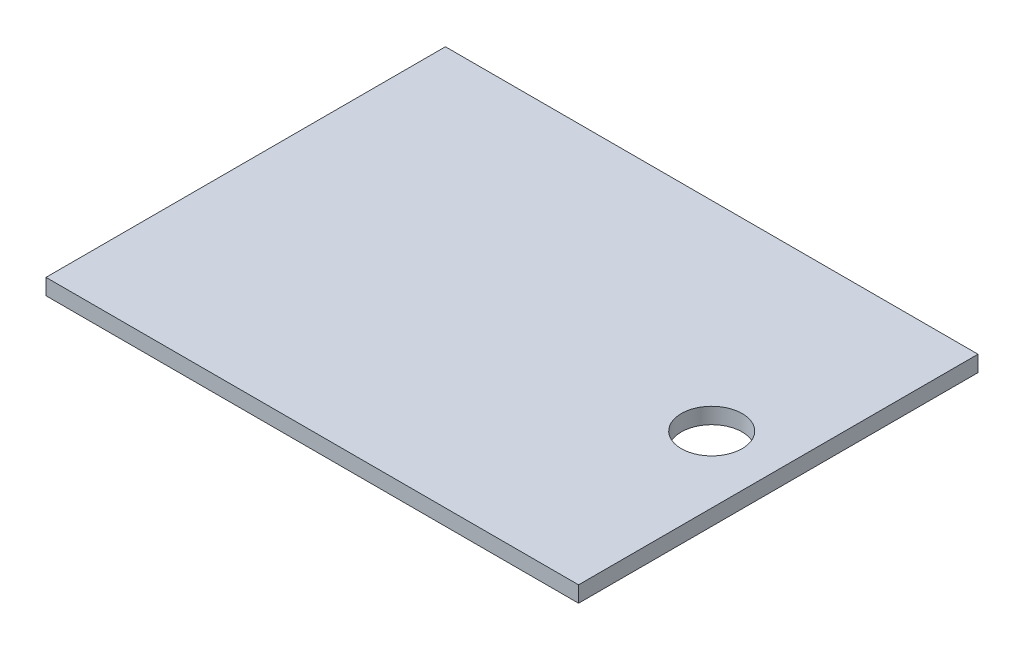
ISO-10303-21;
HEADER;
FILE_DESCRIPTION(('STEP AP214'),'2;1');
FILE_NAME('part.step','',(''),(''),'','','');
FILE_SCHEMA(('AUTOMOTIVE_DESIGN { 1 0 10303 214 1 1 1 1 }'));
ENDSEC;
DATA;
#1=APPLICATION_CONTEXT('core data for automotive mechanical design processes');
#2=APPLICATION_PROTOCOL_DEFINITION('international standard','automotive_design',2000,#1);
#3=PRODUCT_CONTEXT('',#1,'mechanical');
#4=PRODUCT('Part','Part','',(#3));
#5=PRODUCT_RELATED_PRODUCT_CATEGORY('part','',(#4));
#6=PRODUCT_DEFINITION_FORMATION('','',#4);
#7=PRODUCT_DEFINITION_CONTEXT('part definition',#1,'design');
#8=PRODUCT_DEFINITION('design','',#6,#7);
#9=PRODUCT_DEFINITION_SHAPE('','',#8);
#10=(LENGTH_UNIT() NAMED_UNIT(*) SI_UNIT(.MILLI.,.METRE.));
#11=(NAMED_UNIT(*) PLANE_ANGLE_UNIT() SI_UNIT($,.RADIAN.));
#12=(NAMED_UNIT(*) SI_UNIT($,.STERADIAN.) SOLID_ANGLE_UNIT());
#13=UNCERTAINTY_MEASURE_WITH_UNIT(LENGTH_MEASURE(1.E-05),#10,'distance_accuracy_value','');
#14=(GEOMETRIC_REPRESENTATION_CONTEXT(3) GLOBAL_UNCERTAINTY_ASSIGNED_CONTEXT((#13)) GLOBAL_UNIT_ASSIGNED_CONTEXT((#10,
#11,#12)) REPRESENTATION_CONTEXT('',''));
#15=CARTESIAN_POINT('',(0.,0.,0.));
#16=DIRECTION('',(0.,0.,1.));
#17=DIRECTION('',(1.,0.,0.));
#18=AXIS2_PLACEMENT_3D('',#15,#16,#17);
#19=CARTESIAN_POINT('',(0.,6.,0.));
#20=DIRECTION('',(0.,1.,0.));
#21=DIRECTION('',(0.,0.,1.));
#22=AXIS2_PLACEMENT_3D('',#19,#20,#21);
#23=PLANE('',#22);
#24=DIRECTION('',(0.,0.,1.));
#25=VECTOR('',#24,1.);
#26=CARTESIAN_POINT('',(-100.,6.,-75.));
#27=LINE('',#26,#25);
#28=CARTESIAN_POINT('',(-100.,6.,-75.));
#29=VERTEX_POINT('',#28);
#30=CARTESIAN_POINT('',(-100.,6.,75.));
#31=VERTEX_POINT('',#30);
#32=EDGE_CURVE('E85',#29,#31,#27,.T.);
#33=ORIENTED_EDGE('',*,*,#32,.T.);
#34=DIRECTION('',(1.,0.,0.));
#35=VECTOR('',#34,1.);
#36=CARTESIAN_POINT('',(-100.,6.,75.));
#37=LINE('',#36,#35);
#38=CARTESIAN_POINT('',(100.,6.,75.));
#39=VERTEX_POINT('',#38);
#40=EDGE_CURVE('E80',#31,#39,#37,.T.);
#41=ORIENTED_EDGE('',*,*,#40,.T.);
#42=DIRECTION('',(0.,0.,-1.));
#43=VECTOR('',#42,1.);
#44=CARTESIAN_POINT('',(100.,6.,-75.));
#45=LINE('',#44,#43);
#46=CARTESIAN_POINT('',(100.,6.,-75.));
#47=VERTEX_POINT('',#46);
#48=EDGE_CURVE('E83',#39,#47,#45,.T.);
#49=ORIENTED_EDGE('',*,*,#48,.T.);
#50=DIRECTION('',(-1.,0.,0.));
#51=VECTOR('',#50,1.);
#52=CARTESIAN_POINT('',(-100.,6.,-75.));
#53=LINE('',#52,#51);
#54=EDGE_CURVE('E50',#47,#29,#53,.T.);
#55=ORIENTED_EDGE('',*,*,#54,.T.);
#56=EDGE_LOOP('',(#33,#41,#49,#55));
#57=FACE_BOUND('',#56,.T.);
#58=CARTESIAN_POINT('',(75.,6.,0.));
#59=DIRECTION('',(0.,1.,0.));
#60=DIRECTION('',(0.,0.,1.));
#61=AXIS2_PLACEMENT_3D('',#58,#59,#60);
#62=CIRCLE('',#61,11.43);
#63=CARTESIAN_POINT('',(75.,6.,11.43));
#64=VERTEX_POINT('',#63);
#65=EDGE_CURVE('E100',#64,#64,#62,.T.);
#66=ORIENTED_EDGE('',*,*,#65,.F.);
#67=EDGE_LOOP('',(#66));
#68=FACE_BOUND('',#67,.T.);
#69=ADVANCED_FACE('F33',(#57,#68),#23,.T.);
#70=CARTESIAN_POINT('',(0.,0.,0.));
#71=DIRECTION('',(0.,1.,0.));
#72=DIRECTION('',(0.,0.,1.));
#73=AXIS2_PLACEMENT_3D('',#70,#71,#72);
#74=PLANE('',#73);
#75=DIRECTION('',(0.,0.,1.));
#76=VECTOR('',#75,1.);
#77=CARTESIAN_POINT('',(-100.,0.,-75.));
#78=LINE('',#77,#76);
#79=CARTESIAN_POINT('',(-100.,0.,-75.));
#80=VERTEX_POINT('',#79);
#81=CARTESIAN_POINT('',(-100.,0.,75.));
#82=VERTEX_POINT('',#81);
#83=EDGE_CURVE('E97',#80,#82,#78,.T.);
#84=ORIENTED_EDGE('',*,*,#83,.F.);
#85=DIRECTION('',(-1.,0.,0.));
#86=VECTOR('',#85,1.);
#87=CARTESIAN_POINT('',(-100.,0.,-75.));
#88=LINE('',#87,#86);
#89=CARTESIAN_POINT('',(100.,0.,-75.));
#90=VERTEX_POINT('',#89);
#91=EDGE_CURVE('E73',#90,#80,#88,.T.);
#92=ORIENTED_EDGE('',*,*,#91,.F.);
#93=DIRECTION('',(0.,0.,-1.));
#94=VECTOR('',#93,1.);
#95=CARTESIAN_POINT('',(100.,0.,-75.));
#96=LINE('',#95,#94);
#97=CARTESIAN_POINT('',(100.,0.,75.));
#98=VERTEX_POINT('',#97);
#99=EDGE_CURVE('E67',#98,#90,#96,.T.);
#100=ORIENTED_EDGE('',*,*,#99,.F.);
#101=DIRECTION('',(1.,0.,0.));
#102=VECTOR('',#101,1.);
#103=CARTESIAN_POINT('',(-100.,0.,75.));
#104=LINE('',#103,#102);
#105=EDGE_CURVE('E89',#82,#98,#104,.T.);
#106=ORIENTED_EDGE('',*,*,#105,.F.);
#107=EDGE_LOOP('',(#84,#92,#100,#106));
#108=FACE_BOUND('',#107,.T.);
#109=CARTESIAN_POINT('',(75.,0.,0.));
#110=DIRECTION('',(0.,1.,0.));
#111=DIRECTION('',(0.,0.,1.));
#112=AXIS2_PLACEMENT_3D('',#109,#110,#111);
#113=CIRCLE('',#112,11.43);
#114=CARTESIAN_POINT('',(75.,0.,11.43));
#115=VERTEX_POINT('',#114);
#116=EDGE_CURVE('E112',#115,#115,#113,.T.);
#117=ORIENTED_EDGE('',*,*,#116,.T.);
#118=EDGE_LOOP('',(#117));
#119=FACE_BOUND('',#118,.T.);
#120=ADVANCED_FACE('F108',(#108,#119),#74,.F.);
#121=CARTESIAN_POINT('',(-100.,6.,-75.));
#122=DIRECTION('',(1.,0.,0.));
#123=DIRECTION('',(0.,0.,-1.));
#124=AXIS2_PLACEMENT_3D('',#121,#122,#123);
#125=PLANE('',#124);
#126=ORIENTED_EDGE('',*,*,#83,.T.);
#127=DIRECTION('',(0.,-1.,0.));
#128=VECTOR('',#127,1.);
#129=CARTESIAN_POINT('',(-100.,6.,75.));
#130=LINE('',#129,#128);
#131=EDGE_CURVE('E11',#31,#82,#130,.T.);
#132=ORIENTED_EDGE('',*,*,#131,.F.);
#133=ORIENTED_EDGE('',*,*,#32,.F.);
#134=DIRECTION('',(0.,-1.,0.));
#135=VECTOR('',#134,1.);
#136=CARTESIAN_POINT('',(-100.,6.,-75.));
#137=LINE('',#136,#135);
#138=EDGE_CURVE('E93',#29,#80,#137,.T.);
#139=ORIENTED_EDGE('',*,*,#138,.T.);
#140=EDGE_LOOP('',(#126,#132,#133,#139));
#141=FACE_BOUND('',#140,.T.);
#142=ADVANCED_FACE('F35',(#141),#125,.F.);
#143=CARTESIAN_POINT('',(-100.,6.,75.));
#144=DIRECTION('',(0.,0.,-1.));
#145=DIRECTION('',(-1.,0.,0.));
#146=AXIS2_PLACEMENT_3D('',#143,#144,#145);
#147=PLANE('',#146);
#148=ORIENTED_EDGE('',*,*,#105,.T.);
#149=DIRECTION('',(0.,-1.,0.));
#150=VECTOR('',#149,1.);
#151=CARTESIAN_POINT('',(100.,6.,75.));
#152=LINE('',#151,#150);
#153=EDGE_CURVE('E42',#39,#98,#152,.T.);
#154=ORIENTED_EDGE('',*,*,#153,.F.);
#155=ORIENTED_EDGE('',*,*,#40,.F.);
#156=ORIENTED_EDGE('',*,*,#131,.T.);
#157=EDGE_LOOP('',(#148,#154,#155,#156));
#158=FACE_BOUND('',#157,.T.);
#159=ADVANCED_FACE('F88',(#158),#147,.F.);
#160=CARTESIAN_POINT('',(100.,6.,-75.));
#161=DIRECTION('',(-1.,0.,0.));
#162=DIRECTION('',(0.,0.,1.));
#163=AXIS2_PLACEMENT_3D('',#160,#161,#162);
#164=PLANE('',#163);
#165=ORIENTED_EDGE('',*,*,#99,.T.);
#166=DIRECTION('',(0.,-1.,0.));
#167=VECTOR('',#166,1.);
#168=CARTESIAN_POINT('',(100.,6.,-75.));
#169=LINE('',#168,#167);
#170=EDGE_CURVE('E90',#47,#90,#169,.T.);
#171=ORIENTED_EDGE('',*,*,#170,.F.);
#172=ORIENTED_EDGE('',*,*,#48,.F.);
#173=ORIENTED_EDGE('',*,*,#153,.T.);
#174=EDGE_LOOP('',(#165,#171,#172,#173));
#175=FACE_BOUND('',#174,.T.);
#176=ADVANCED_FACE('F91',(#175),#164,.F.);
#177=CARTESIAN_POINT('',(-100.,6.,-75.));
#178=DIRECTION('',(0.,0.,1.));
#179=DIRECTION('',(1.,0.,0.));
#180=AXIS2_PLACEMENT_3D('',#177,#178,#179);
#181=PLANE('',#180);
#182=ORIENTED_EDGE('',*,*,#91,.T.);
#183=ORIENTED_EDGE('',*,*,#138,.F.);
#184=ORIENTED_EDGE('',*,*,#54,.F.);
#185=ORIENTED_EDGE('',*,*,#170,.T.);
#186=EDGE_LOOP('',(#182,#183,#184,#185));
#187=FACE_BOUND('',#186,.T.);
#188=ADVANCED_FACE('F105',(#187),#181,.F.);
#189=CARTESIAN_POINT('',(75.,6.,0.));
#190=DIRECTION('',(0.,-1.,0.));
#191=DIRECTION('',(0.,0.,-1.));
#192=AXIS2_PLACEMENT_3D('',#189,#190,#191);
#193=CYLINDRICAL_SURFACE('',#192,11.43);
#194=ORIENTED_EDGE('',*,*,#65,.T.);
#195=EDGE_LOOP('',(#194));
#196=FACE_BOUND('',#195,.T.);
#197=ORIENTED_EDGE('',*,*,#116,.F.);
#198=EDGE_LOOP('',(#197));
#199=FACE_BOUND('',#198,.T.);
#200=ADVANCED_FACE('F118',(#196,#199),#193,.F.);
#201=CLOSED_SHELL('',(#69,#120,#142,#159,#176,#188,#200));
#202=MANIFOLD_SOLID_BREP('B2',#201);
#203=ADVANCED_BREP_SHAPE_REPRESENTATION('',(#18,#202),#14);
#204=SHAPE_DEFINITION_REPRESENTATION(#9,#203);
ENDSEC;
END-ISO-10303-21;
